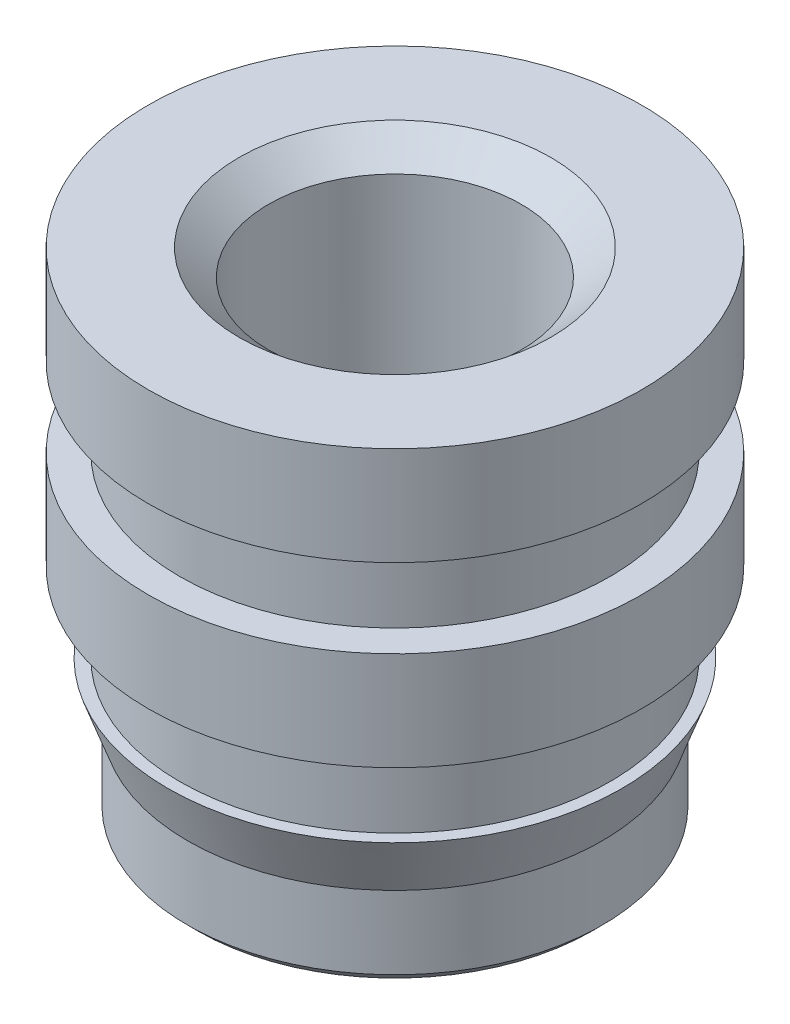
ISO-10303-21;
HEADER;
FILE_DESCRIPTION(('STEP AP214'),'2;1');
FILE_NAME('part.step','',(''),(''),'','','');
FILE_SCHEMA(('AUTOMOTIVE_DESIGN { 1 0 10303 214 1 1 1 1 }'));
ENDSEC;
DATA;
#1=APPLICATION_CONTEXT('core data for automotive mechanical design processes');
#2=APPLICATION_PROTOCOL_DEFINITION('international standard','automotive_design',2000,#1);
#3=PRODUCT_CONTEXT('',#1,'mechanical');
#4=PRODUCT('Part','Part','',(#3));
#5=PRODUCT_RELATED_PRODUCT_CATEGORY('part','',(#4));
#6=PRODUCT_DEFINITION_FORMATION('','',#4);
#7=PRODUCT_DEFINITION_CONTEXT('part definition',#1,'design');
#8=PRODUCT_DEFINITION('design','',#6,#7);
#9=PRODUCT_DEFINITION_SHAPE('','',#8);
#10=(LENGTH_UNIT() NAMED_UNIT(*) SI_UNIT(.MILLI.,.METRE.));
#11=(NAMED_UNIT(*) PLANE_ANGLE_UNIT() SI_UNIT($,.RADIAN.));
#12=(NAMED_UNIT(*) SI_UNIT($,.STERADIAN.) SOLID_ANGLE_UNIT());
#13=UNCERTAINTY_MEASURE_WITH_UNIT(LENGTH_MEASURE(1.E-05),#10,'distance_accuracy_value','');
#14=(GEOMETRIC_REPRESENTATION_CONTEXT(3) GLOBAL_UNCERTAINTY_ASSIGNED_CONTEXT((#13)) GLOBAL_UNIT_ASSIGNED_CONTEXT((#10,
#11,#12)) REPRESENTATION_CONTEXT('',''));
#15=CARTESIAN_POINT('',(0.,0.,0.));
#16=DIRECTION('',(0.,0.,1.));
#17=DIRECTION('',(1.,0.,0.));
#18=AXIS2_PLACEMENT_3D('',#15,#16,#17);
#19=CARTESIAN_POINT('',(0.,2.794,0.));
#20=DIRECTION('',(0.,1.,0.));
#21=DIRECTION('',(0.,0.,1.));
#22=AXIS2_PLACEMENT_3D('',#19,#20,#21);
#23=CYLINDRICAL_SURFACE('',#22,3.175);
#24=CARTESIAN_POINT('',(0.,4.064,0.));
#25=DIRECTION('',(0.,1.,0.));
#26=DIRECTION('',(0.,0.,1.));
#27=AXIS2_PLACEMENT_3D('',#24,#25,#26);
#28=CIRCLE('',#27,3.175);
#29=CARTESIAN_POINT('',(0.,4.064,3.175));
#30=VERTEX_POINT('',#29);
#31=EDGE_CURVE('E67',#30,#30,#28,.T.);
#32=ORIENTED_EDGE('',*,*,#31,.F.);
#33=EDGE_LOOP('',(#32));
#34=FACE_BOUND('',#33,.T.);
#35=CARTESIAN_POINT('',(0.,2.794,0.));
#36=DIRECTION('',(0.,1.,0.));
#37=DIRECTION('',(0.,0.,1.));
#38=AXIS2_PLACEMENT_3D('',#35,#36,#37);
#39=CIRCLE('',#38,3.175);
#40=CARTESIAN_POINT('',(0.,2.794,3.175));
#41=VERTEX_POINT('',#40);
#42=EDGE_CURVE('E19',#41,#41,#39,.F.);
#43=ORIENTED_EDGE('',*,*,#42,.F.);
#44=EDGE_LOOP('',(#43));
#45=FACE_BOUND('',#44,.T.);
#46=ADVANCED_FACE('F15',(#34,#45),#23,.T.);
#47=CARTESIAN_POINT('',(-3.175,2.794,3.2385));
#48=DIRECTION('',(0.,-1.,0.));
#49=DIRECTION('',(0.,0.,-1.));
#50=AXIS2_PLACEMENT_3D('',#47,#48,#49);
#51=PLANE('',#50);
#52=CARTESIAN_POINT('',(0.,2.794,0.));
#53=DIRECTION('',(0.,1.,0.));
#54=DIRECTION('',(0.,0.,1.));
#55=AXIS2_PLACEMENT_3D('',#52,#53,#54);
#56=CIRCLE('',#55,2.7686);
#57=CARTESIAN_POINT('',(0.,2.794,2.7686));
#58=VERTEX_POINT('',#57);
#59=EDGE_CURVE('E65',#58,#58,#56,.F.);
#60=ORIENTED_EDGE('',*,*,#59,.F.);
#61=EDGE_LOOP('',(#60));
#62=FACE_BOUND('',#61,.T.);
#63=ORIENTED_EDGE('',*,*,#42,.T.);
#64=EDGE_LOOP('',(#63));
#65=FACE_BOUND('',#64,.T.);
#66=ADVANCED_FACE('F74',(#62,#65),#51,.T.);
#67=CARTESIAN_POINT('',(-3.175,4.064,-3.2385));
#68=DIRECTION('',(0.,1.,0.));
#69=DIRECTION('',(0.,0.,1.));
#70=AXIS2_PLACEMENT_3D('',#67,#68,#69);
#71=PLANE('',#70);
#72=CARTESIAN_POINT('',(0.,4.064,0.));
#73=DIRECTION('',(0.,1.,0.));
#74=DIRECTION('',(0.,0.,1.));
#75=AXIS2_PLACEMENT_3D('',#72,#73,#74);
#76=CIRCLE('',#75,2.7686);
#77=CARTESIAN_POINT('',(0.,4.064,2.7686));
#78=VERTEX_POINT('',#77);
#79=EDGE_CURVE('E62',#78,#78,#76,.T.);
#80=ORIENTED_EDGE('',*,*,#79,.F.);
#81=EDGE_LOOP('',(#80));
#82=FACE_BOUND('',#81,.T.);
#83=ORIENTED_EDGE('',*,*,#31,.T.);
#84=EDGE_LOOP('',(#83));
#85=FACE_BOUND('',#84,.T.);
#86=ADVANCED_FACE('F83',(#82,#85),#71,.T.);
#87=CARTESIAN_POINT('',(0.,1.778,0.));
#88=DIRECTION('',(0.,1.,0.));
#89=DIRECTION('',(0.,0.,1.));
#90=AXIS2_PLACEMENT_3D('',#87,#88,#89);
#91=CYLINDRICAL_SURFACE('',#90,2.7686);
#92=ORIENTED_EDGE('',*,*,#59,.T.);
#93=EDGE_LOOP('',(#92));
#94=FACE_BOUND('',#93,.T.);
#95=CARTESIAN_POINT('',(0.,1.778,0.));
#96=DIRECTION('',(0.,1.,0.));
#97=DIRECTION('',(0.,0.,1.));
#98=AXIS2_PLACEMENT_3D('',#95,#96,#97);
#99=CIRCLE('',#98,2.7686);
#100=CARTESIAN_POINT('',(0.,1.778,2.7686));
#101=VERTEX_POINT('',#100);
#102=EDGE_CURVE('E59',#101,#101,#99,.F.);
#103=ORIENTED_EDGE('',*,*,#102,.F.);
#104=EDGE_LOOP('',(#103));
#105=FACE_BOUND('',#104,.T.);
#106=ADVANCED_FACE('F139',(#94,#105),#91,.T.);
#107=CARTESIAN_POINT('',(0.,4.064,0.));
#108=DIRECTION('',(0.,1.,0.));
#109=DIRECTION('',(0.,0.,1.));
#110=AXIS2_PLACEMENT_3D('',#107,#108,#109);
#111=CYLINDRICAL_SURFACE('',#110,2.7686);
#112=CARTESIAN_POINT('',(0.,5.08,0.));
#113=DIRECTION('',(0.,1.,0.));
#114=DIRECTION('',(0.,0.,1.));
#115=AXIS2_PLACEMENT_3D('',#112,#113,#114);
#116=CIRCLE('',#115,2.7686);
#117=CARTESIAN_POINT('',(0.,5.08,2.7686));
#118=VERTEX_POINT('',#117);
#119=EDGE_CURVE('E56',#118,#118,#116,.T.);
#120=ORIENTED_EDGE('',*,*,#119,.F.);
#121=EDGE_LOOP('',(#120));
#122=FACE_BOUND('',#121,.T.);
#123=ORIENTED_EDGE('',*,*,#79,.T.);
#124=EDGE_LOOP('',(#123));
#125=FACE_BOUND('',#124,.T.);
#126=ADVANCED_FACE('F135',(#122,#125),#111,.T.);
#127=CARTESIAN_POINT('',(-2.921,1.778,-2.97942));
#128=DIRECTION('',(0.,1.,0.));
#129=DIRECTION('',(0.,0.,1.));
#130=AXIS2_PLACEMENT_3D('',#127,#128,#129);
#131=PLANE('',#130);
#132=ORIENTED_EDGE('',*,*,#102,.T.);
#133=EDGE_LOOP('',(#132));
#134=FACE_BOUND('',#133,.T.);
#135=CARTESIAN_POINT('',(0.,1.778,0.));
#136=DIRECTION('',(0.,1.,0.));
#137=DIRECTION('',(0.,0.,1.));
#138=AXIS2_PLACEMENT_3D('',#135,#136,#137);
#139=CIRCLE('',#138,2.921);
#140=CARTESIAN_POINT('',(0.,1.778,2.921));
#141=VERTEX_POINT('',#140);
#142=EDGE_CURVE('E53',#141,#141,#139,.F.);
#143=ORIENTED_EDGE('',*,*,#142,.F.);
#144=EDGE_LOOP('',(#143));
#145=FACE_BOUND('',#144,.T.);
#146=ADVANCED_FACE('F131',(#134,#145),#131,.T.);
#147=CARTESIAN_POINT('',(-3.175,5.08,3.2385));
#148=DIRECTION('',(0.,-1.,0.));
#149=DIRECTION('',(0.,0.,-1.));
#150=AXIS2_PLACEMENT_3D('',#147,#148,#149);
#151=PLANE('',#150);
#152=ORIENTED_EDGE('',*,*,#119,.T.);
#153=EDGE_LOOP('',(#152));
#154=FACE_BOUND('',#153,.T.);
#155=CARTESIAN_POINT('',(0.,5.08,0.));
#156=DIRECTION('',(0.,1.,0.));
#157=DIRECTION('',(0.,0.,1.));
#158=AXIS2_PLACEMENT_3D('',#155,#156,#157);
#159=CIRCLE('',#158,3.175);
#160=CARTESIAN_POINT('',(0.,5.08,3.175));
#161=VERTEX_POINT('',#160);
#162=EDGE_CURVE('E42',#161,#161,#159,.T.);
#163=ORIENTED_EDGE('',*,*,#162,.F.);
#164=EDGE_LOOP('',(#163));
#165=FACE_BOUND('',#164,.T.);
#166=ADVANCED_FACE('F127',(#154,#165),#151,.T.);
#167=CARTESIAN_POINT('',(0.,1.0668,0.));
#168=DIRECTION('',(0.,1.,0.));
#169=DIRECTION('',(0.,0.,1.));
#170=AXIS2_PLACEMENT_3D('',#167,#168,#169);
#171=CONICAL_SURFACE('',#170,2.667,0.343023940420703);
#172=ORIENTED_EDGE('',*,*,#142,.T.);
#173=EDGE_LOOP('',(#172));
#174=FACE_BOUND('',#173,.T.);
#175=CARTESIAN_POINT('',(0.,1.0668,0.));
#176=DIRECTION('',(0.,-1.,0.));
#177=DIRECTION('',(0.,0.,-1.));
#178=AXIS2_PLACEMENT_3D('',#175,#176,#177);
#179=CIRCLE('',#178,2.667);
#180=CARTESIAN_POINT('',(0.,1.0668,-2.667));
#181=VERTEX_POINT('',#180);
#182=EDGE_CURVE('E39',#181,#181,#179,.T.);
#183=ORIENTED_EDGE('',*,*,#182,.F.);
#184=EDGE_LOOP('',(#183));
#185=FACE_BOUND('',#184,.T.);
#186=ADVANCED_FACE('F123',(#174,#185),#171,.T.);
#187=CARTESIAN_POINT('',(0.,5.08,0.));
#188=DIRECTION('',(0.,1.,0.));
#189=DIRECTION('',(0.,0.,1.));
#190=AXIS2_PLACEMENT_3D('',#187,#188,#189);
#191=CYLINDRICAL_SURFACE('',#190,3.175);
#192=CARTESIAN_POINT('',(0.,6.35,0.));
#193=DIRECTION('',(0.,1.,0.));
#194=DIRECTION('',(0.,0.,1.));
#195=AXIS2_PLACEMENT_3D('',#192,#193,#194);
#196=CIRCLE('',#195,3.175);
#197=CARTESIAN_POINT('',(0.,6.35,3.175));
#198=VERTEX_POINT('',#197);
#199=EDGE_CURVE('E38',#198,#198,#196,.T.);
#200=ORIENTED_EDGE('',*,*,#199,.F.);
#201=EDGE_LOOP('',(#200));
#202=FACE_BOUND('',#201,.T.);
#203=ORIENTED_EDGE('',*,*,#162,.T.);
#204=EDGE_LOOP('',(#203));
#205=FACE_BOUND('',#204,.T.);
#206=ADVANCED_FACE('F119',(#202,#205),#191,.T.);
#207=CARTESIAN_POINT('',(0.,0.127,0.));
#208=DIRECTION('',(0.,1.,0.));
#209=DIRECTION('',(0.,0.,1.));
#210=AXIS2_PLACEMENT_3D('',#207,#208,#209);
#211=CYLINDRICAL_SURFACE('',#210,2.667);
#212=ORIENTED_EDGE('',*,*,#182,.T.);
#213=EDGE_LOOP('',(#212));
#214=FACE_BOUND('',#213,.T.);
#215=CARTESIAN_POINT('',(0.,0.127,0.));
#216=DIRECTION('',(0.,-1.,0.));
#217=DIRECTION('',(0.,0.,-1.));
#218=AXIS2_PLACEMENT_3D('',#215,#216,#217);
#219=CIRCLE('',#218,2.667);
#220=CARTESIAN_POINT('',(0.,0.127,-2.667));
#221=VERTEX_POINT('',#220);
#222=EDGE_CURVE('E34',#221,#221,#219,.T.);
#223=ORIENTED_EDGE('',*,*,#222,.F.);
#224=EDGE_LOOP('',(#223));
#225=FACE_BOUND('',#224,.T.);
#226=ADVANCED_FACE('F113',(#214,#225),#211,.T.);
#227=CARTESIAN_POINT('',(-3.175,6.35,-3.2385));
#228=DIRECTION('',(0.,1.,0.));
#229=DIRECTION('',(0.,0.,1.));
#230=AXIS2_PLACEMENT_3D('',#227,#228,#229);
#231=PLANE('',#230);
#232=CARTESIAN_POINT('',(0.,6.35,0.));
#233=DIRECTION('',(0.,1.,0.));
#234=DIRECTION('',(0.,0.,1.));
#235=AXIS2_PLACEMENT_3D('',#232,#233,#234);
#236=CIRCLE('',#235,2.0066);
#237=CARTESIAN_POINT('',(0.,6.35,2.0066));
#238=VERTEX_POINT('',#237);
#239=EDGE_CURVE('E37',#238,#238,#236,.T.);
#240=ORIENTED_EDGE('',*,*,#239,.F.);
#241=EDGE_LOOP('',(#240));
#242=FACE_BOUND('',#241,.T.);
#243=ORIENTED_EDGE('',*,*,#199,.T.);
#244=EDGE_LOOP('',(#243));
#245=FACE_BOUND('',#244,.T.);
#246=ADVANCED_FACE('F104',(#242,#245),#231,.T.);
#247=CARTESIAN_POINT('',(0.,0.,0.));
#248=DIRECTION('',(0.,1.,0.));
#249=DIRECTION('',(-1.,0.,0.));
#250=AXIS2_PLACEMENT_3D('',#247,#248,#249);
#251=CONICAL_SURFACE('',#250,2.54,0.78539816339745);
#252=ORIENTED_EDGE('',*,*,#222,.T.);
#253=EDGE_LOOP('',(#252));
#254=FACE_BOUND('',#253,.T.);
#255=CARTESIAN_POINT('',(0.,0.,0.));
#256=DIRECTION('',(0.,1.,0.));
#257=DIRECTION('',(-1.,0.,0.));
#258=AXIS2_PLACEMENT_3D('',#255,#256,#257);
#259=CIRCLE('',#258,2.54);
#260=CARTESIAN_POINT('',(-2.54,0.,0.));
#261=VERTEX_POINT('',#260);
#262=EDGE_CURVE('E33',#261,#261,#259,.F.);
#263=ORIENTED_EDGE('',*,*,#262,.F.);
#264=EDGE_LOOP('',(#263));
#265=FACE_BOUND('',#264,.T.);
#266=ADVANCED_FACE('F102',(#254,#265),#251,.T.);
#267=CARTESIAN_POINT('',(0.,6.01880175289202,0.));
#268=DIRECTION('',(0.,1.,0.));
#269=DIRECTION('',(0.,0.,1.));
#270=AXIS2_PLACEMENT_3D('',#267,#268,#269);
#271=CONICAL_SURFACE('',#270,1.6256,0.855211333477226);
#272=CARTESIAN_POINT('',(0.,6.01880175289202,0.));
#273=DIRECTION('',(0.,1.,0.));
#274=DIRECTION('',(0.,0.,1.));
#275=AXIS2_PLACEMENT_3D('',#272,#273,#274);
#276=CIRCLE('',#275,1.6256);
#277=CARTESIAN_POINT('',(0.,6.01880175289202,1.6256));
#278=VERTEX_POINT('',#277);
#279=EDGE_CURVE('E28',#278,#278,#276,.T.);
#280=ORIENTED_EDGE('',*,*,#279,.F.);
#281=EDGE_LOOP('',(#280));
#282=FACE_BOUND('',#281,.T.);
#283=ORIENTED_EDGE('',*,*,#239,.T.);
#284=EDGE_LOOP('',(#283));
#285=FACE_BOUND('',#284,.T.);
#286=ADVANCED_FACE('F98',(#282,#285),#271,.F.);
#287=CARTESIAN_POINT('',(-2.5908,0.,2.5908));
#288=DIRECTION('',(0.,-1.,0.));
#289=DIRECTION('',(0.,0.,-1.));
#290=AXIS2_PLACEMENT_3D('',#287,#288,#289);
#291=PLANE('',#290);
#292=CARTESIAN_POINT('',(0.,0.,0.));
#293=DIRECTION('',(0.,-1.,0.));
#294=DIRECTION('',(0.,0.,-1.));
#295=AXIS2_PLACEMENT_3D('',#292,#293,#294);
#296=CIRCLE('',#295,2.0066);
#297=CARTESIAN_POINT('',(0.,0.,-2.0066));
#298=VERTEX_POINT('',#297);
#299=EDGE_CURVE('E23',#298,#298,#296,.T.);
#300=ORIENTED_EDGE('',*,*,#299,.F.);
#301=EDGE_LOOP('',(#300));
#302=FACE_BOUND('',#301,.T.);
#303=ORIENTED_EDGE('',*,*,#262,.T.);
#304=EDGE_LOOP('',(#303));
#305=FACE_BOUND('',#304,.T.);
#306=ADVANCED_FACE('F91',(#302,#305),#291,.T.);
#307=CARTESIAN_POINT('',(0.,0.331198247107983,0.));
#308=DIRECTION('',(0.,1.,0.));
#309=DIRECTION('',(0.,0.,1.));
#310=AXIS2_PLACEMENT_3D('',#307,#308,#309);
#311=CYLINDRICAL_SURFACE('',#310,1.6256);
#312=CARTESIAN_POINT('',(0.,0.331198247107983,0.));
#313=DIRECTION('',(0.,1.,0.));
#314=DIRECTION('',(0.,0.,1.));
#315=AXIS2_PLACEMENT_3D('',#312,#313,#314);
#316=CIRCLE('',#315,1.6256);
#317=CARTESIAN_POINT('',(0.,0.331198247107983,1.6256));
#318=VERTEX_POINT('',#317);
#319=EDGE_CURVE('E10',#318,#318,#316,.T.);
#320=ORIENTED_EDGE('',*,*,#319,.F.);
#321=EDGE_LOOP('',(#320));
#322=FACE_BOUND('',#321,.T.);
#323=ORIENTED_EDGE('',*,*,#279,.T.);
#324=EDGE_LOOP('',(#323));
#325=FACE_BOUND('',#324,.T.);
#326=ADVANCED_FACE('F87',(#322,#325),#311,.F.);
#327=CARTESIAN_POINT('',(0.,0.331198247107983,0.));
#328=DIRECTION('',(0.,-1.,0.));
#329=DIRECTION('',(0.,0.,-1.));
#330=AXIS2_PLACEMENT_3D('',#327,#328,#329);
#331=CONICAL_SURFACE('',#330,1.6256,0.85521133347722);
#332=ORIENTED_EDGE('',*,*,#319,.T.);
#333=EDGE_LOOP('',(#332));
#334=FACE_BOUND('',#333,.T.);
#335=ORIENTED_EDGE('',*,*,#299,.T.);
#336=EDGE_LOOP('',(#335));
#337=FACE_BOUND('',#336,.T.);
#338=ADVANCED_FACE('F17',(#334,#337),#331,.F.);
#339=CLOSED_SHELL('',(#46,#66,#86,#106,#126,#146,#166,#186,#206,#226,#246,#266,#286,#306,#326,#338));
#340=MANIFOLD_SOLID_BREP('B1',#339);
#341=ADVANCED_BREP_SHAPE_REPRESENTATION('',(#18,#340),#14);
#342=SHAPE_DEFINITION_REPRESENTATION(#9,#341);
ENDSEC;
END-ISO-10303-21;
